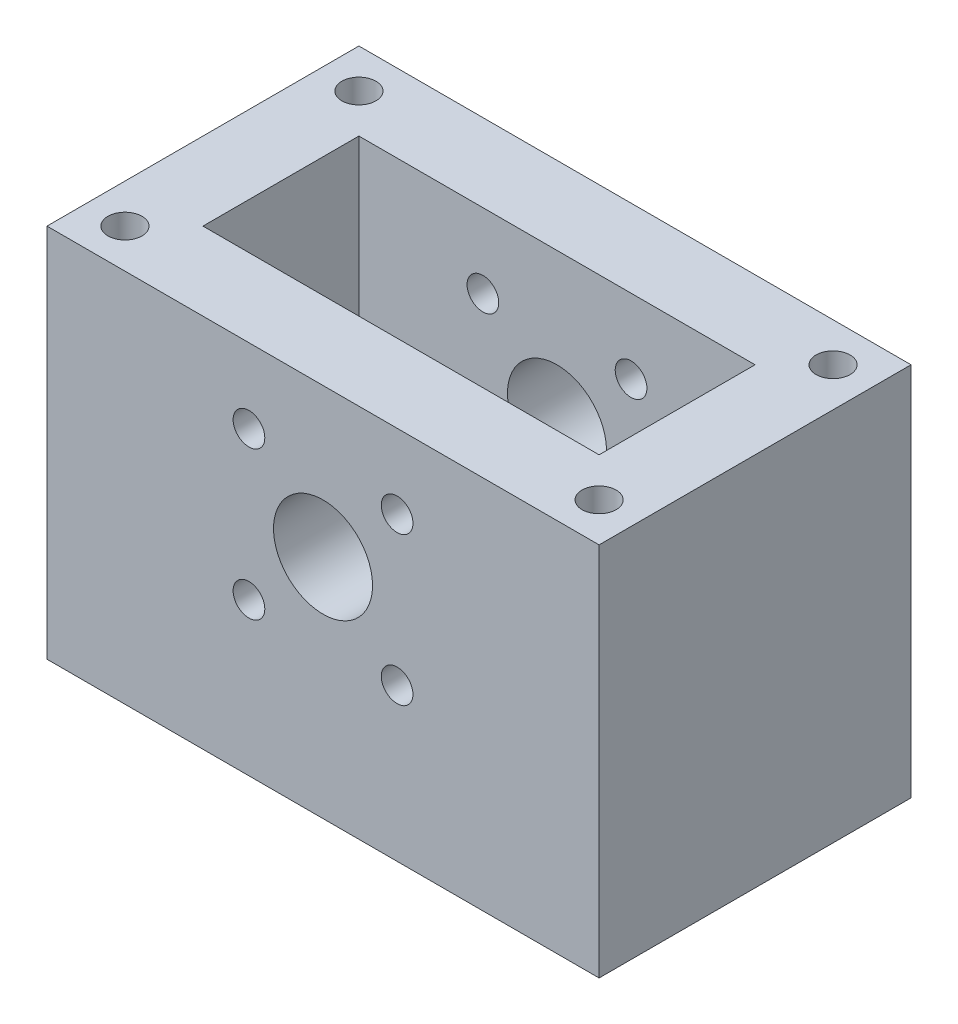
ISO-10303-21;
HEADER;
FILE_DESCRIPTION(('STEP AP214'),'2;1');
FILE_NAME('part.step','',(''),(''),'','','');
FILE_SCHEMA(('AUTOMOTIVE_DESIGN { 1 0 10303 214 1 1 1 1 }'));
ENDSEC;
DATA;
#1=APPLICATION_CONTEXT('core data for automotive mechanical design processes');
#2=APPLICATION_PROTOCOL_DEFINITION('international standard','automotive_design',2000,#1);
#3=PRODUCT_CONTEXT('',#1,'mechanical');
#4=PRODUCT('Part','Part','',(#3));
#5=PRODUCT_RELATED_PRODUCT_CATEGORY('part','',(#4));
#6=PRODUCT_DEFINITION_FORMATION('','',#4);
#7=PRODUCT_DEFINITION_CONTEXT('part definition',#1,'design');
#8=PRODUCT_DEFINITION('design','',#6,#7);
#9=PRODUCT_DEFINITION_SHAPE('','',#8);
#10=(LENGTH_UNIT() NAMED_UNIT(*) SI_UNIT(.MILLI.,.METRE.));
#11=(NAMED_UNIT(*) PLANE_ANGLE_UNIT() SI_UNIT($,.RADIAN.));
#12=(NAMED_UNIT(*) SI_UNIT($,.STERADIAN.) SOLID_ANGLE_UNIT());
#13=UNCERTAINTY_MEASURE_WITH_UNIT(LENGTH_MEASURE(1.E-05),#10,'distance_accuracy_value','');
#14=(GEOMETRIC_REPRESENTATION_CONTEXT(3) GLOBAL_UNCERTAINTY_ASSIGNED_CONTEXT((#13)) GLOBAL_UNIT_ASSIGNED_CONTEXT((#10,
#11,#12)) REPRESENTATION_CONTEXT('',''));
#15=CARTESIAN_POINT('',(0.,0.,0.));
#16=DIRECTION('',(0.,0.,1.));
#17=DIRECTION('',(1.,0.,0.));
#18=AXIS2_PLACEMENT_3D('',#15,#16,#17);
#19=CARTESIAN_POINT('',(25.4,0.,20.));
#20=DIRECTION('',(1.,0.,0.));
#21=DIRECTION('',(0.,1.,0.));
#22=AXIS2_PLACEMENT_3D('',#19,#20,#21);
#23=PLANE('',#22);
#24=DIRECTION('',(0.,1.,0.));
#25=VECTOR('',#24,1.);
#26=CARTESIAN_POINT('',(25.4,0.,15.));
#27=LINE('',#26,#25);
#28=CARTESIAN_POINT('',(25.4,-19.05,15.));
#29=VERTEX_POINT('',#28);
#30=CARTESIAN_POINT('',(25.4,0.,15.));
#31=VERTEX_POINT('',#30);
#32=EDGE_CURVE('E127',#29,#31,#27,.T.);
#33=ORIENTED_EDGE('',*,*,#32,.T.);
#34=DIRECTION('',(0.,0.,-1.));
#35=VECTOR('',#34,1.);
#36=CARTESIAN_POINT('',(25.4,0.,20.));
#37=LINE('',#36,#35);
#38=CARTESIAN_POINT('',(25.4,0.,5.));
#39=VERTEX_POINT('',#38);
#40=EDGE_CURVE('E226',#31,#39,#37,.T.);
#41=ORIENTED_EDGE('',*,*,#40,.T.);
#42=DIRECTION('',(0.,-1.,0.));
#43=VECTOR('',#42,1.);
#44=CARTESIAN_POINT('',(25.4,0.,5.));
#45=LINE('',#44,#43);
#46=CARTESIAN_POINT('',(25.4,-19.05,5.));
#47=VERTEX_POINT('',#46);
#48=EDGE_CURVE('E244',#39,#47,#45,.T.);
#49=ORIENTED_EDGE('',*,*,#48,.T.);
#50=DIRECTION('',(0.,0.,-1.));
#51=VECTOR('',#50,1.);
#52=CARTESIAN_POINT('',(25.4,-19.05,20.));
#53=LINE('',#52,#51);
#54=EDGE_CURVE('E224',#29,#47,#53,.T.);
#55=ORIENTED_EDGE('',*,*,#54,.F.);
#56=EDGE_LOOP('',(#33,#41,#49,#55));
#57=FACE_BOUND('',#56,.T.);
#58=ADVANCED_FACE('F110',(#57),#23,.F.);
#59=CARTESIAN_POINT('',(0.,-19.05,20.));
#60=DIRECTION('',(0.,1.,0.));
#61=DIRECTION('',(0.,0.,1.));
#62=AXIS2_PLACEMENT_3D('',#59,#60,#61);
#63=PLANE('',#62);
#64=DIRECTION('',(0.,0.,-1.));
#65=VECTOR('',#64,1.);
#66=CARTESIAN_POINT('',(0.,-19.05,20.));
#67=LINE('',#66,#65);
#68=CARTESIAN_POINT('',(0.,-19.05,15.));
#69=VERTEX_POINT('',#68);
#70=CARTESIAN_POINT('',(0.,-19.05,5.));
#71=VERTEX_POINT('',#70);
#72=EDGE_CURVE('E222',#69,#71,#67,.T.);
#73=ORIENTED_EDGE('',*,*,#72,.F.);
#74=DIRECTION('',(-1.,0.,0.));
#75=VECTOR('',#74,1.);
#76=CARTESIAN_POINT('',(0.,-19.05,15.));
#77=LINE('',#76,#75);
#78=EDGE_CURVE('E135',#29,#69,#77,.T.);
#79=ORIENTED_EDGE('',*,*,#78,.F.);
#80=ORIENTED_EDGE('',*,*,#54,.T.);
#81=DIRECTION('',(1.,0.,0.));
#82=VECTOR('',#81,1.);
#83=CARTESIAN_POINT('',(0.,-19.05,5.));
#84=LINE('',#83,#82);
#85=EDGE_CURVE('E12',#71,#47,#84,.T.);
#86=ORIENTED_EDGE('',*,*,#85,.F.);
#87=EDGE_LOOP('',(#73,#79,#80,#86));
#88=FACE_BOUND('',#87,.T.);
#89=ADVANCED_FACE('F286',(#88),#63,.T.);
#90=CARTESIAN_POINT('',(0.,0.,20.));
#91=DIRECTION('',(1.,0.,0.));
#92=DIRECTION('',(0.,1.,0.));
#93=AXIS2_PLACEMENT_3D('',#90,#91,#92);
#94=PLANE('',#93);
#95=DIRECTION('',(0.,0.,-1.));
#96=VECTOR('',#95,1.);
#97=CARTESIAN_POINT('',(0.,0.,20.));
#98=LINE('',#97,#96);
#99=CARTESIAN_POINT('',(0.,0.,15.));
#100=VERTEX_POINT('',#99);
#101=CARTESIAN_POINT('',(0.,0.,5.));
#102=VERTEX_POINT('',#101);
#103=EDGE_CURVE('E220',#100,#102,#98,.T.);
#104=ORIENTED_EDGE('',*,*,#103,.F.);
#105=DIRECTION('',(0.,1.,0.));
#106=VECTOR('',#105,1.);
#107=CARTESIAN_POINT('',(0.,0.,15.));
#108=LINE('',#107,#106);
#109=EDGE_CURVE('E351',#69,#100,#108,.T.);
#110=ORIENTED_EDGE('',*,*,#109,.F.);
#111=ORIENTED_EDGE('',*,*,#72,.T.);
#112=DIRECTION('',(0.,-1.,0.));
#113=VECTOR('',#112,1.);
#114=CARTESIAN_POINT('',(0.,0.,5.));
#115=LINE('',#114,#113);
#116=EDGE_CURVE('E119',#102,#71,#115,.T.);
#117=ORIENTED_EDGE('',*,*,#116,.F.);
#118=EDGE_LOOP('',(#104,#110,#111,#117));
#119=FACE_BOUND('',#118,.T.);
#120=ADVANCED_FACE('F291',(#119),#94,.T.);
#121=CARTESIAN_POINT('',(0.,0.,5.));
#122=DIRECTION('',(0.,1.,0.));
#123=DIRECTION('',(0.,0.,1.));
#124=AXIS2_PLACEMENT_3D('',#121,#122,#123);
#125=PLANE('',#124);
#126=CARTESIAN_POINT('',(-2.5,0.,17.5));
#127=DIRECTION('',(0.,1.,0.));
#128=DIRECTION('',(0.,0.,1.));
#129=AXIS2_PLACEMENT_3D('',#126,#127,#128);
#130=CIRCLE('',#129,1.0922);
#131=CARTESIAN_POINT('',(-2.5,0.,18.5922));
#132=VERTEX_POINT('',#131);
#133=EDGE_CURVE('E394',#132,#132,#130,.T.);
#134=ORIENTED_EDGE('',*,*,#133,.F.);
#135=EDGE_LOOP('',(#134));
#136=FACE_BOUND('',#135,.T.);
#137=CARTESIAN_POINT('',(27.9,0.,17.5));
#138=DIRECTION('',(0.,1.,0.));
#139=DIRECTION('',(0.,0.,1.));
#140=AXIS2_PLACEMENT_3D('',#137,#138,#139);
#141=CIRCLE('',#140,1.0922);
#142=CARTESIAN_POINT('',(27.9,0.,18.5922));
#143=VERTEX_POINT('',#142);
#144=EDGE_CURVE('E400',#143,#143,#141,.T.);
#145=ORIENTED_EDGE('',*,*,#144,.F.);
#146=EDGE_LOOP('',(#145));
#147=FACE_BOUND('',#146,.T.);
#148=CARTESIAN_POINT('',(27.9,0.,2.5));
#149=DIRECTION('',(0.,1.,0.));
#150=DIRECTION('',(0.,0.,1.));
#151=AXIS2_PLACEMENT_3D('',#148,#149,#150);
#152=CIRCLE('',#151,1.0922);
#153=CARTESIAN_POINT('',(27.9,0.,3.5922));
#154=VERTEX_POINT('',#153);
#155=EDGE_CURVE('E406',#154,#154,#152,.T.);
#156=ORIENTED_EDGE('',*,*,#155,.F.);
#157=EDGE_LOOP('',(#156));
#158=FACE_BOUND('',#157,.T.);
#159=CARTESIAN_POINT('',(-2.5,0.,2.5));
#160=DIRECTION('',(0.,1.,0.));
#161=DIRECTION('',(0.,0.,1.));
#162=AXIS2_PLACEMENT_3D('',#159,#160,#161);
#163=CIRCLE('',#162,1.0922);
#164=CARTESIAN_POINT('',(-2.5,0.,3.5922));
#165=VERTEX_POINT('',#164);
#166=EDGE_CURVE('E388',#165,#165,#163,.T.);
#167=ORIENTED_EDGE('',*,*,#166,.F.);
#168=EDGE_LOOP('',(#167));
#169=FACE_BOUND('',#168,.T.);
#170=ORIENTED_EDGE('',*,*,#40,.F.);
#171=DIRECTION('',(-1.,0.,0.));
#172=VECTOR('',#171,1.);
#173=CARTESIAN_POINT('',(0.,0.,15.));
#174=LINE('',#173,#172);
#175=EDGE_CURVE('E348',#31,#100,#174,.T.);
#176=ORIENTED_EDGE('',*,*,#175,.T.);
#177=ORIENTED_EDGE('',*,*,#103,.T.);
#178=DIRECTION('',(1.,0.,0.));
#179=VECTOR('',#178,1.);
#180=CARTESIAN_POINT('',(0.,0.,5.));
#181=LINE('',#180,#179);
#182=EDGE_CURVE('E247',#102,#39,#181,.T.);
#183=ORIENTED_EDGE('',*,*,#182,.T.);
#184=EDGE_LOOP('',(#170,#176,#177,#183));
#185=FACE_BOUND('',#184,.T.);
#186=DIRECTION('',(1.,0.,0.));
#187=VECTOR('',#186,1.);
#188=CARTESIAN_POINT('',(0.,0.,0.));
#189=LINE('',#188,#187);
#190=CARTESIAN_POINT('',(-5.00000000000001,0.,0.));
#191=VERTEX_POINT('',#190);
#192=CARTESIAN_POINT('',(30.4,0.,0.));
#193=VERTEX_POINT('',#192);
#194=EDGE_CURVE('E114',#191,#193,#189,.T.);
#195=ORIENTED_EDGE('',*,*,#194,.F.);
#196=DIRECTION('',(0.,0.,-1.));
#197=VECTOR('',#196,1.);
#198=CARTESIAN_POINT('',(-5.00000000000001,0.,20.));
#199=LINE('',#198,#197);
#200=CARTESIAN_POINT('',(-5.00000000000001,0.,20.));
#201=VERTEX_POINT('',#200);
#202=EDGE_CURVE('E217',#201,#191,#199,.T.);
#203=ORIENTED_EDGE('',*,*,#202,.F.);
#204=DIRECTION('',(1.,0.,0.));
#205=VECTOR('',#204,1.);
#206=CARTESIAN_POINT('',(0.,0.,20.));
#207=LINE('',#206,#205);
#208=CARTESIAN_POINT('',(30.4,0.,20.));
#209=VERTEX_POINT('',#208);
#210=EDGE_CURVE('E205',#201,#209,#207,.T.);
#211=ORIENTED_EDGE('',*,*,#210,.T.);
#212=DIRECTION('',(0.,0.,-1.));
#213=VECTOR('',#212,1.);
#214=CARTESIAN_POINT('',(30.4,0.,20.));
#215=LINE('',#214,#213);
#216=EDGE_CURVE('E201',#209,#193,#215,.T.);
#217=ORIENTED_EDGE('',*,*,#216,.T.);
#218=EDGE_LOOP('',(#195,#203,#211,#217));
#219=FACE_BOUND('',#218,.T.);
#220=ADVANCED_FACE('F272',(#136,#147,#158,#169,#185,#219),#125,.T.);
#221=CARTESIAN_POINT('',(7.9502,-4.7752,5.));
#222=DIRECTION('',(0.,0.,-1.));
#223=DIRECTION('',(-1.,0.,0.));
#224=AXIS2_PLACEMENT_3D('',#221,#222,#223);
#225=CYLINDRICAL_SURFACE('',#224,1.016);
#226=CARTESIAN_POINT('',(7.9502,-4.7752,5.));
#227=DIRECTION('',(0.,0.,1.));
#228=DIRECTION('',(1.,0.,0.));
#229=AXIS2_PLACEMENT_3D('',#226,#227,#228);
#230=CIRCLE('',#229,1.016);
#231=CARTESIAN_POINT('',(8.9662,-4.7752,5.));
#232=VERTEX_POINT('',#231);
#233=EDGE_CURVE('E241',#232,#232,#230,.T.);
#234=ORIENTED_EDGE('',*,*,#233,.T.);
#235=EDGE_LOOP('',(#234));
#236=FACE_BOUND('',#235,.T.);
#237=CARTESIAN_POINT('',(7.9502,-4.7752,0.));
#238=DIRECTION('',(0.,0.,1.));
#239=DIRECTION('',(1.,0.,0.));
#240=AXIS2_PLACEMENT_3D('',#237,#238,#239);
#241=CIRCLE('',#240,1.016);
#242=CARTESIAN_POINT('',(8.9662,-4.7752,0.));
#243=VERTEX_POINT('',#242);
#244=EDGE_CURVE('E262',#243,#243,#241,.T.);
#245=ORIENTED_EDGE('',*,*,#244,.F.);
#246=EDGE_LOOP('',(#245));
#247=FACE_BOUND('',#246,.T.);
#248=ADVANCED_FACE('F304',(#236,#247),#225,.F.);
#249=CARTESIAN_POINT('',(17.4498,-4.7752,5.));
#250=DIRECTION('',(0.,0.,-1.));
#251=DIRECTION('',(-1.,0.,0.));
#252=AXIS2_PLACEMENT_3D('',#249,#250,#251);
#253=CYLINDRICAL_SURFACE('',#252,1.016);
#254=CARTESIAN_POINT('',(17.4498,-4.7752,5.));
#255=DIRECTION('',(0.,0.,1.));
#256=DIRECTION('',(1.,0.,0.));
#257=AXIS2_PLACEMENT_3D('',#254,#255,#256);
#258=CIRCLE('',#257,1.016);
#259=CARTESIAN_POINT('',(18.4658,-4.7752,5.));
#260=VERTEX_POINT('',#259);
#261=EDGE_CURVE('E238',#260,#260,#258,.T.);
#262=ORIENTED_EDGE('',*,*,#261,.T.);
#263=EDGE_LOOP('',(#262));
#264=FACE_BOUND('',#263,.T.);
#265=CARTESIAN_POINT('',(17.4498,-4.7752,0.));
#266=DIRECTION('',(0.,0.,1.));
#267=DIRECTION('',(1.,0.,0.));
#268=AXIS2_PLACEMENT_3D('',#265,#266,#267);
#269=CIRCLE('',#268,1.016);
#270=CARTESIAN_POINT('',(18.4658,-4.7752,0.));
#271=VERTEX_POINT('',#270);
#272=EDGE_CURVE('E260',#271,#271,#269,.T.);
#273=ORIENTED_EDGE('',*,*,#272,.F.);
#274=EDGE_LOOP('',(#273));
#275=FACE_BOUND('',#274,.T.);
#276=ADVANCED_FACE('F308',(#264,#275),#253,.F.);
#277=CARTESIAN_POINT('',(7.9502,-14.2748,5.));
#278=DIRECTION('',(0.,0.,-1.));
#279=DIRECTION('',(-1.,0.,0.));
#280=AXIS2_PLACEMENT_3D('',#277,#278,#279);
#281=CYLINDRICAL_SURFACE('',#280,1.016);
#282=CARTESIAN_POINT('',(7.9502,-14.2748,5.));
#283=DIRECTION('',(0.,0.,1.));
#284=DIRECTION('',(1.,0.,0.));
#285=AXIS2_PLACEMENT_3D('',#282,#283,#284);
#286=CIRCLE('',#285,1.016);
#287=CARTESIAN_POINT('',(8.9662,-14.2748,5.));
#288=VERTEX_POINT('',#287);
#289=EDGE_CURVE('E235',#288,#288,#286,.T.);
#290=ORIENTED_EDGE('',*,*,#289,.T.);
#291=EDGE_LOOP('',(#290));
#292=FACE_BOUND('',#291,.T.);
#293=CARTESIAN_POINT('',(7.9502,-14.2748,0.));
#294=DIRECTION('',(0.,0.,1.));
#295=DIRECTION('',(1.,0.,0.));
#296=AXIS2_PLACEMENT_3D('',#293,#294,#295);
#297=CIRCLE('',#296,1.016);
#298=CARTESIAN_POINT('',(8.9662,-14.2748,0.));
#299=VERTEX_POINT('',#298);
#300=EDGE_CURVE('E257',#299,#299,#297,.T.);
#301=ORIENTED_EDGE('',*,*,#300,.F.);
#302=EDGE_LOOP('',(#301));
#303=FACE_BOUND('',#302,.T.);
#304=ADVANCED_FACE('F312',(#292,#303),#281,.F.);
#305=CARTESIAN_POINT('',(17.4498,-14.2748,5.));
#306=DIRECTION('',(0.,0.,-1.));
#307=DIRECTION('',(-1.,0.,0.));
#308=AXIS2_PLACEMENT_3D('',#305,#306,#307);
#309=CYLINDRICAL_SURFACE('',#308,1.016);
#310=CARTESIAN_POINT('',(17.4498,-14.2748,5.));
#311=DIRECTION('',(0.,0.,1.));
#312=DIRECTION('',(1.,0.,0.));
#313=AXIS2_PLACEMENT_3D('',#310,#311,#312);
#314=CIRCLE('',#313,1.016);
#315=CARTESIAN_POINT('',(18.4658,-14.2748,5.));
#316=VERTEX_POINT('',#315);
#317=EDGE_CURVE('E232',#316,#316,#314,.T.);
#318=ORIENTED_EDGE('',*,*,#317,.T.);
#319=EDGE_LOOP('',(#318));
#320=FACE_BOUND('',#319,.T.);
#321=CARTESIAN_POINT('',(17.4498,-14.2748,0.));
#322=DIRECTION('',(0.,0.,1.));
#323=DIRECTION('',(1.,0.,0.));
#324=AXIS2_PLACEMENT_3D('',#321,#322,#323);
#325=CIRCLE('',#324,1.016);
#326=CARTESIAN_POINT('',(18.4658,-14.2748,0.));
#327=VERTEX_POINT('',#326);
#328=EDGE_CURVE('E254',#327,#327,#325,.T.);
#329=ORIENTED_EDGE('',*,*,#328,.F.);
#330=EDGE_LOOP('',(#329));
#331=FACE_BOUND('',#330,.T.);
#332=ADVANCED_FACE('F315',(#320,#331),#309,.F.);
#333=CARTESIAN_POINT('',(12.7,-9.525,5.));
#334=DIRECTION('',(0.,0.,-1.));
#335=DIRECTION('',(-1.,0.,0.));
#336=AXIS2_PLACEMENT_3D('',#333,#334,#335);
#337=CYLINDRICAL_SURFACE('',#336,3.175);
#338=CARTESIAN_POINT('',(12.7,-9.525,5.));
#339=DIRECTION('',(0.,0.,1.));
#340=DIRECTION('',(1.,0.,0.));
#341=AXIS2_PLACEMENT_3D('',#338,#339,#340);
#342=CIRCLE('',#341,3.175);
#343=CARTESIAN_POINT('',(15.875,-9.525,5.));
#344=VERTEX_POINT('',#343);
#345=EDGE_CURVE('E229',#344,#344,#342,.T.);
#346=ORIENTED_EDGE('',*,*,#345,.T.);
#347=EDGE_LOOP('',(#346));
#348=FACE_BOUND('',#347,.T.);
#349=CARTESIAN_POINT('',(12.7,-9.525,0.));
#350=DIRECTION('',(0.,0.,1.));
#351=DIRECTION('',(1.,0.,0.));
#352=AXIS2_PLACEMENT_3D('',#349,#350,#351);
#353=CIRCLE('',#352,3.175);
#354=CARTESIAN_POINT('',(15.875,-9.525,0.));
#355=VERTEX_POINT('',#354);
#356=EDGE_CURVE('E200',#355,#355,#353,.T.);
#357=ORIENTED_EDGE('',*,*,#356,.F.);
#358=EDGE_LOOP('',(#357));
#359=FACE_BOUND('',#358,.T.);
#360=ADVANCED_FACE('F112',(#348,#359),#337,.F.);
#361=CARTESIAN_POINT('',(0.,0.,5.));
#362=DIRECTION('',(0.,0.,1.));
#363=DIRECTION('',(1.,0.,0.));
#364=AXIS2_PLACEMENT_3D('',#361,#362,#363);
#365=PLANE('',#364);
#366=ORIENTED_EDGE('',*,*,#345,.F.);
#367=EDGE_LOOP('',(#366));
#368=FACE_BOUND('',#367,.T.);
#369=ORIENTED_EDGE('',*,*,#317,.F.);
#370=EDGE_LOOP('',(#369));
#371=FACE_BOUND('',#370,.T.);
#372=ORIENTED_EDGE('',*,*,#289,.F.);
#373=EDGE_LOOP('',(#372));
#374=FACE_BOUND('',#373,.T.);
#375=ORIENTED_EDGE('',*,*,#261,.F.);
#376=EDGE_LOOP('',(#375));
#377=FACE_BOUND('',#376,.T.);
#378=ORIENTED_EDGE('',*,*,#233,.F.);
#379=EDGE_LOOP('',(#378));
#380=FACE_BOUND('',#379,.T.);
#381=ORIENTED_EDGE('',*,*,#48,.F.);
#382=ORIENTED_EDGE('',*,*,#182,.F.);
#383=ORIENTED_EDGE('',*,*,#116,.T.);
#384=ORIENTED_EDGE('',*,*,#85,.T.);
#385=EDGE_LOOP('',(#381,#382,#383,#384));
#386=FACE_BOUND('',#385,.T.);
#387=ADVANCED_FACE('F296',(#368,#371,#374,#377,#380,#386),#365,.T.);
#388=CARTESIAN_POINT('',(0.,0.,0.));
#389=DIRECTION('',(0.,0.,1.));
#390=DIRECTION('',(1.,0.,0.));
#391=AXIS2_PLACEMENT_3D('',#388,#389,#390);
#392=PLANE('',#391);
#393=ORIENTED_EDGE('',*,*,#194,.T.);
#394=DIRECTION('',(0.,-1.,0.));
#395=VECTOR('',#394,1.);
#396=CARTESIAN_POINT('',(30.4,0.,0.));
#397=LINE('',#396,#395);
#398=CARTESIAN_POINT('',(30.4,-24.05,0.));
#399=VERTEX_POINT('',#398);
#400=EDGE_CURVE('E213',#193,#399,#397,.T.);
#401=ORIENTED_EDGE('',*,*,#400,.T.);
#402=DIRECTION('',(1.,0.,0.));
#403=VECTOR('',#402,1.);
#404=CARTESIAN_POINT('',(0.,-24.05,0.));
#405=LINE('',#404,#403);
#406=CARTESIAN_POINT('',(-5.,-24.05,0.));
#407=VERTEX_POINT('',#406);
#408=EDGE_CURVE('E196',#407,#399,#405,.T.);
#409=ORIENTED_EDGE('',*,*,#408,.F.);
#410=DIRECTION('',(0.,-1.,0.));
#411=VECTOR('',#410,1.);
#412=CARTESIAN_POINT('',(-5.00000000000001,0.,0.));
#413=LINE('',#412,#411);
#414=EDGE_CURVE('E190',#191,#407,#413,.T.);
#415=ORIENTED_EDGE('',*,*,#414,.F.);
#416=EDGE_LOOP('',(#393,#401,#409,#415));
#417=FACE_BOUND('',#416,.T.);
#418=ORIENTED_EDGE('',*,*,#356,.T.);
#419=EDGE_LOOP('',(#418));
#420=FACE_BOUND('',#419,.T.);
#421=ORIENTED_EDGE('',*,*,#328,.T.);
#422=EDGE_LOOP('',(#421));
#423=FACE_BOUND('',#422,.T.);
#424=ORIENTED_EDGE('',*,*,#300,.T.);
#425=EDGE_LOOP('',(#424));
#426=FACE_BOUND('',#425,.T.);
#427=ORIENTED_EDGE('',*,*,#272,.T.);
#428=EDGE_LOOP('',(#427));
#429=FACE_BOUND('',#428,.T.);
#430=ORIENTED_EDGE('',*,*,#244,.T.);
#431=EDGE_LOOP('',(#430));
#432=FACE_BOUND('',#431,.T.);
#433=ADVANCED_FACE('F268',(#417,#420,#423,#426,#429,#432),#392,.F.);
#434=CARTESIAN_POINT('',(0.,-24.05,20.));
#435=DIRECTION('',(0.,1.,0.));
#436=DIRECTION('',(0.,0.,1.));
#437=AXIS2_PLACEMENT_3D('',#434,#435,#436);
#438=PLANE('',#437);
#439=ORIENTED_EDGE('',*,*,#408,.T.);
#440=DIRECTION('',(0.,0.,-1.));
#441=VECTOR('',#440,1.);
#442=CARTESIAN_POINT('',(30.4,-24.05,20.));
#443=LINE('',#442,#441);
#444=CARTESIAN_POINT('',(30.4,-24.05,20.));
#445=VERTEX_POINT('',#444);
#446=EDGE_CURVE('E193',#445,#399,#443,.T.);
#447=ORIENTED_EDGE('',*,*,#446,.F.);
#448=DIRECTION('',(1.,0.,0.));
#449=VECTOR('',#448,1.);
#450=CARTESIAN_POINT('',(0.,-24.05,20.));
#451=LINE('',#450,#449);
#452=CARTESIAN_POINT('',(-5.,-24.05,20.));
#453=VERTEX_POINT('',#452);
#454=EDGE_CURVE('E178',#453,#445,#451,.T.);
#455=ORIENTED_EDGE('',*,*,#454,.F.);
#456=DIRECTION('',(0.,0.,-1.));
#457=VECTOR('',#456,1.);
#458=CARTESIAN_POINT('',(-5.,-24.05,20.));
#459=LINE('',#458,#457);
#460=EDGE_CURVE('E211',#453,#407,#459,.T.);
#461=ORIENTED_EDGE('',*,*,#460,.T.);
#462=EDGE_LOOP('',(#439,#447,#455,#461));
#463=FACE_BOUND('',#462,.T.);
#464=ADVANCED_FACE('F194',(#463),#438,.F.);
#465=CARTESIAN_POINT('',(30.4,0.,20.));
#466=DIRECTION('',(1.,0.,0.));
#467=DIRECTION('',(0.,1.,0.));
#468=AXIS2_PLACEMENT_3D('',#465,#466,#467);
#469=PLANE('',#468);
#470=ORIENTED_EDGE('',*,*,#400,.F.);
#471=ORIENTED_EDGE('',*,*,#216,.F.);
#472=DIRECTION('',(0.,-1.,0.));
#473=VECTOR('',#472,1.);
#474=CARTESIAN_POINT('',(30.4,0.,20.));
#475=LINE('',#474,#473);
#476=EDGE_CURVE('E183',#209,#445,#475,.T.);
#477=ORIENTED_EDGE('',*,*,#476,.T.);
#478=ORIENTED_EDGE('',*,*,#446,.T.);
#479=EDGE_LOOP('',(#470,#471,#477,#478));
#480=FACE_BOUND('',#479,.T.);
#481=ADVANCED_FACE('F203',(#480),#469,.T.);
#482=CARTESIAN_POINT('',(-5.00000000000001,0.,20.));
#483=DIRECTION('',(1.,0.,0.));
#484=DIRECTION('',(0.,1.,0.));
#485=AXIS2_PLACEMENT_3D('',#482,#483,#484);
#486=PLANE('',#485);
#487=ORIENTED_EDGE('',*,*,#414,.T.);
#488=ORIENTED_EDGE('',*,*,#460,.F.);
#489=DIRECTION('',(0.,-1.,0.));
#490=VECTOR('',#489,1.);
#491=CARTESIAN_POINT('',(-5.00000000000001,0.,20.));
#492=LINE('',#491,#490);
#493=EDGE_CURVE('E186',#201,#453,#492,.T.);
#494=ORIENTED_EDGE('',*,*,#493,.F.);
#495=ORIENTED_EDGE('',*,*,#202,.T.);
#496=EDGE_LOOP('',(#487,#488,#494,#495));
#497=FACE_BOUND('',#496,.T.);
#498=ADVANCED_FACE('F274',(#497),#486,.F.);
#499=CARTESIAN_POINT('',(0.,0.,20.));
#500=DIRECTION('',(0.,0.,1.));
#501=DIRECTION('',(1.,0.,0.));
#502=AXIS2_PLACEMENT_3D('',#499,#500,#501);
#503=PLANE('',#502);
#504=ORIENTED_EDGE('',*,*,#454,.T.);
#505=ORIENTED_EDGE('',*,*,#476,.F.);
#506=ORIENTED_EDGE('',*,*,#210,.F.);
#507=ORIENTED_EDGE('',*,*,#493,.T.);
#508=EDGE_LOOP('',(#504,#505,#506,#507));
#509=FACE_BOUND('',#508,.T.);
#510=CARTESIAN_POINT('',(17.4498,-14.2748,20.));
#511=DIRECTION('',(0.,0.,1.));
#512=DIRECTION('',(1.,0.,0.));
#513=AXIS2_PLACEMENT_3D('',#510,#511,#512);
#514=CIRCLE('',#513,1.016);
#515=CARTESIAN_POINT('',(18.4658,-14.2748,20.));
#516=VERTEX_POINT('',#515);
#517=EDGE_CURVE('E382',#516,#516,#514,.T.);
#518=ORIENTED_EDGE('',*,*,#517,.F.);
#519=EDGE_LOOP('',(#518));
#520=FACE_BOUND('',#519,.T.);
#521=CARTESIAN_POINT('',(7.9502,-14.2748,20.));
#522=DIRECTION('',(0.,0.,1.));
#523=DIRECTION('',(1.,0.,0.));
#524=AXIS2_PLACEMENT_3D('',#521,#522,#523);
#525=CIRCLE('',#524,1.016);
#526=CARTESIAN_POINT('',(8.9662,-14.2748,20.));
#527=VERTEX_POINT('',#526);
#528=EDGE_CURVE('E376',#527,#527,#525,.T.);
#529=ORIENTED_EDGE('',*,*,#528,.F.);
#530=EDGE_LOOP('',(#529));
#531=FACE_BOUND('',#530,.T.);
#532=CARTESIAN_POINT('',(17.4498,-4.7752,20.));
#533=DIRECTION('',(0.,0.,1.));
#534=DIRECTION('',(1.,0.,0.));
#535=AXIS2_PLACEMENT_3D('',#532,#533,#534);
#536=CIRCLE('',#535,1.016);
#537=CARTESIAN_POINT('',(18.4658,-4.7752,20.));
#538=VERTEX_POINT('',#537);
#539=EDGE_CURVE('E370',#538,#538,#536,.T.);
#540=ORIENTED_EDGE('',*,*,#539,.F.);
#541=EDGE_LOOP('',(#540));
#542=FACE_BOUND('',#541,.T.);
#543=CARTESIAN_POINT('',(7.9502,-4.7752,20.));
#544=DIRECTION('',(0.,0.,1.));
#545=DIRECTION('',(1.,0.,0.));
#546=AXIS2_PLACEMENT_3D('',#543,#544,#545);
#547=CIRCLE('',#546,1.016);
#548=CARTESIAN_POINT('',(8.9662,-4.7752,20.));
#549=VERTEX_POINT('',#548);
#550=EDGE_CURVE('E364',#549,#549,#547,.T.);
#551=ORIENTED_EDGE('',*,*,#550,.F.);
#552=EDGE_LOOP('',(#551));
#553=FACE_BOUND('',#552,.T.);
#554=CARTESIAN_POINT('',(12.7,-9.525,20.));
#555=DIRECTION('',(0.,0.,1.));
#556=DIRECTION('',(1.,0.,0.));
#557=AXIS2_PLACEMENT_3D('',#554,#555,#556);
#558=CIRCLE('',#557,3.175);
#559=CARTESIAN_POINT('',(15.875,-9.525,20.));
#560=VERTEX_POINT('',#559);
#561=EDGE_CURVE('E357',#560,#560,#558,.T.);
#562=ORIENTED_EDGE('',*,*,#561,.F.);
#563=EDGE_LOOP('',(#562));
#564=FACE_BOUND('',#563,.T.);
#565=ADVANCED_FACE('F180',(#509,#520,#531,#542,#553,#564),#503,.T.);
#566=CARTESIAN_POINT('',(0.,0.,15.));
#567=DIRECTION('',(0.,0.,1.));
#568=DIRECTION('',(1.,0.,0.));
#569=AXIS2_PLACEMENT_3D('',#566,#567,#568);
#570=PLANE('',#569);
#571=CARTESIAN_POINT('',(17.4498,-14.2748,15.));
#572=DIRECTION('',(0.,0.,1.));
#573=DIRECTION('',(1.,0.,0.));
#574=AXIS2_PLACEMENT_3D('',#571,#572,#573);
#575=CIRCLE('',#574,1.016);
#576=CARTESIAN_POINT('',(18.4658,-14.2748,15.));
#577=VERTEX_POINT('',#576);
#578=EDGE_CURVE('E379',#577,#577,#575,.T.);
#579=ORIENTED_EDGE('',*,*,#578,.T.);
#580=EDGE_LOOP('',(#579));
#581=FACE_BOUND('',#580,.T.);
#582=CARTESIAN_POINT('',(7.9502,-14.2748,15.));
#583=DIRECTION('',(0.,0.,1.));
#584=DIRECTION('',(1.,0.,0.));
#585=AXIS2_PLACEMENT_3D('',#582,#583,#584);
#586=CIRCLE('',#585,1.016);
#587=CARTESIAN_POINT('',(8.9662,-14.2748,15.));
#588=VERTEX_POINT('',#587);
#589=EDGE_CURVE('E373',#588,#588,#586,.T.);
#590=ORIENTED_EDGE('',*,*,#589,.T.);
#591=EDGE_LOOP('',(#590));
#592=FACE_BOUND('',#591,.T.);
#593=CARTESIAN_POINT('',(17.4498,-4.7752,15.));
#594=DIRECTION('',(0.,0.,1.));
#595=DIRECTION('',(1.,0.,0.));
#596=AXIS2_PLACEMENT_3D('',#593,#594,#595);
#597=CIRCLE('',#596,1.016);
#598=CARTESIAN_POINT('',(18.4658,-4.7752,15.));
#599=VERTEX_POINT('',#598);
#600=EDGE_CURVE('E367',#599,#599,#597,.T.);
#601=ORIENTED_EDGE('',*,*,#600,.T.);
#602=EDGE_LOOP('',(#601));
#603=FACE_BOUND('',#602,.T.);
#604=CARTESIAN_POINT('',(7.9502,-4.7752,15.));
#605=DIRECTION('',(0.,0.,1.));
#606=DIRECTION('',(1.,0.,0.));
#607=AXIS2_PLACEMENT_3D('',#604,#605,#606);
#608=CIRCLE('',#607,1.016);
#609=CARTESIAN_POINT('',(8.9662,-4.7752,15.));
#610=VERTEX_POINT('',#609);
#611=EDGE_CURVE('E362',#610,#610,#608,.T.);
#612=ORIENTED_EDGE('',*,*,#611,.T.);
#613=EDGE_LOOP('',(#612));
#614=FACE_BOUND('',#613,.T.);
#615=CARTESIAN_POINT('',(12.7,-9.525,15.));
#616=DIRECTION('',(0.,0.,1.));
#617=DIRECTION('',(1.,0.,0.));
#618=AXIS2_PLACEMENT_3D('',#615,#616,#617);
#619=CIRCLE('',#618,3.175);
#620=CARTESIAN_POINT('',(15.875,-9.525,15.));
#621=VERTEX_POINT('',#620);
#622=EDGE_CURVE('E353',#621,#621,#619,.T.);
#623=ORIENTED_EDGE('',*,*,#622,.T.);
#624=EDGE_LOOP('',(#623));
#625=FACE_BOUND('',#624,.T.);
#626=ORIENTED_EDGE('',*,*,#109,.T.);
#627=ORIENTED_EDGE('',*,*,#175,.F.);
#628=ORIENTED_EDGE('',*,*,#32,.F.);
#629=ORIENTED_EDGE('',*,*,#78,.T.);
#630=EDGE_LOOP('',(#626,#627,#628,#629));
#631=FACE_BOUND('',#630,.T.);
#632=ADVANCED_FACE('F281',(#581,#592,#603,#614,#625,#631),#570,.F.);
#633=CARTESIAN_POINT('',(12.7,-9.525,15.));
#634=DIRECTION('',(0.,0.,1.));
#635=DIRECTION('',(1.,0.,0.));
#636=AXIS2_PLACEMENT_3D('',#633,#634,#635);
#637=CYLINDRICAL_SURFACE('',#636,3.175);
#638=ORIENTED_EDGE('',*,*,#622,.F.);
#639=EDGE_LOOP('',(#638));
#640=FACE_BOUND('',#639,.T.);
#641=ORIENTED_EDGE('',*,*,#561,.T.);
#642=EDGE_LOOP('',(#641));
#643=FACE_BOUND('',#642,.T.);
#644=ADVANCED_FACE('F451',(#640,#643),#637,.F.);
#645=CARTESIAN_POINT('',(7.9502,-4.7752,15.));
#646=DIRECTION('',(0.,0.,1.));
#647=DIRECTION('',(1.,0.,0.));
#648=AXIS2_PLACEMENT_3D('',#645,#646,#647);
#649=CYLINDRICAL_SURFACE('',#648,1.016);
#650=ORIENTED_EDGE('',*,*,#611,.F.);
#651=EDGE_LOOP('',(#650));
#652=FACE_BOUND('',#651,.T.);
#653=ORIENTED_EDGE('',*,*,#550,.T.);
#654=EDGE_LOOP('',(#653));
#655=FACE_BOUND('',#654,.T.);
#656=ADVANCED_FACE('F447',(#652,#655),#649,.F.);
#657=CARTESIAN_POINT('',(17.4498,-4.7752,15.));
#658=DIRECTION('',(0.,0.,1.));
#659=DIRECTION('',(1.,0.,0.));
#660=AXIS2_PLACEMENT_3D('',#657,#658,#659);
#661=CYLINDRICAL_SURFACE('',#660,1.016);
#662=ORIENTED_EDGE('',*,*,#600,.F.);
#663=EDGE_LOOP('',(#662));
#664=FACE_BOUND('',#663,.T.);
#665=ORIENTED_EDGE('',*,*,#539,.T.);
#666=EDGE_LOOP('',(#665));
#667=FACE_BOUND('',#666,.T.);
#668=ADVANCED_FACE('F443',(#664,#667),#661,.F.);
#669=CARTESIAN_POINT('',(7.9502,-14.2748,15.));
#670=DIRECTION('',(0.,0.,1.));
#671=DIRECTION('',(1.,0.,0.));
#672=AXIS2_PLACEMENT_3D('',#669,#670,#671);
#673=CYLINDRICAL_SURFACE('',#672,1.016);
#674=ORIENTED_EDGE('',*,*,#589,.F.);
#675=EDGE_LOOP('',(#674));
#676=FACE_BOUND('',#675,.T.);
#677=ORIENTED_EDGE('',*,*,#528,.T.);
#678=EDGE_LOOP('',(#677));
#679=FACE_BOUND('',#678,.T.);
#680=ADVANCED_FACE('F435',(#676,#679),#673,.F.);
#681=CARTESIAN_POINT('',(17.4498,-14.2748,15.));
#682=DIRECTION('',(0.,0.,1.));
#683=DIRECTION('',(1.,0.,0.));
#684=AXIS2_PLACEMENT_3D('',#681,#682,#683);
#685=CYLINDRICAL_SURFACE('',#684,1.016);
#686=ORIENTED_EDGE('',*,*,#578,.F.);
#687=EDGE_LOOP('',(#686));
#688=FACE_BOUND('',#687,.T.);
#689=ORIENTED_EDGE('',*,*,#517,.T.);
#690=EDGE_LOOP('',(#689));
#691=FACE_BOUND('',#690,.T.);
#692=ADVANCED_FACE('F426',(#688,#691),#685,.F.);
#693=CARTESIAN_POINT('',(-2.5,-10.,2.5));
#694=DIRECTION('',(0.,1.,0.));
#695=DIRECTION('',(0.,0.,1.));
#696=AXIS2_PLACEMENT_3D('',#693,#694,#695);
#697=CYLINDRICAL_SURFACE('',#696,1.0922);
#698=CARTESIAN_POINT('',(-2.5,-10.,2.5));
#699=DIRECTION('',(0.,1.,0.));
#700=DIRECTION('',(0.,0.,1.));
#701=AXIS2_PLACEMENT_3D('',#698,#699,#700);
#702=CIRCLE('',#701,1.0922);
#703=CARTESIAN_POINT('',(-2.5,-10.,3.5922));
#704=VERTEX_POINT('',#703);
#705=EDGE_CURVE('E385',#704,#704,#702,.T.);
#706=ORIENTED_EDGE('',*,*,#705,.F.);
#707=EDGE_LOOP('',(#706));
#708=FACE_BOUND('',#707,.T.);
#709=ORIENTED_EDGE('',*,*,#166,.T.);
#710=EDGE_LOOP('',(#709));
#711=FACE_BOUND('',#710,.T.);
#712=ADVANCED_FACE('F424',(#708,#711),#697,.F.);
#713=CARTESIAN_POINT('',(-2.5,-10.,2.5));
#714=DIRECTION('',(0.,1.,0.));
#715=DIRECTION('',(0.,0.,1.));
#716=AXIS2_PLACEMENT_3D('',#713,#714,#715);
#717=PLANE('',#716);
#718=ORIENTED_EDGE('',*,*,#705,.T.);
#719=EDGE_LOOP('',(#718));
#720=FACE_BOUND('',#719,.T.);
#721=ADVANCED_FACE('F417',(#720),#717,.T.);
#722=CARTESIAN_POINT('',(27.9,-10.,2.5));
#723=DIRECTION('',(0.,1.,0.));
#724=DIRECTION('',(0.,0.,1.));
#725=AXIS2_PLACEMENT_3D('',#722,#723,#724);
#726=CYLINDRICAL_SURFACE('',#725,1.0922);
#727=CARTESIAN_POINT('',(27.9,-10.,2.5));
#728=DIRECTION('',(0.,1.,0.));
#729=DIRECTION('',(0.,0.,1.));
#730=AXIS2_PLACEMENT_3D('',#727,#728,#729);
#731=CIRCLE('',#730,1.0922);
#732=CARTESIAN_POINT('',(27.9,-10.,3.5922));
#733=VERTEX_POINT('',#732);
#734=EDGE_CURVE('E391',#733,#733,#731,.T.);
#735=ORIENTED_EDGE('',*,*,#734,.F.);
#736=EDGE_LOOP('',(#735));
#737=FACE_BOUND('',#736,.T.);
#738=ORIENTED_EDGE('',*,*,#155,.T.);
#739=EDGE_LOOP('',(#738));
#740=FACE_BOUND('',#739,.T.);
#741=ADVANCED_FACE('F414',(#737,#740),#726,.F.);
#742=CARTESIAN_POINT('',(27.9,-10.,2.5));
#743=DIRECTION('',(0.,1.,0.));
#744=DIRECTION('',(0.,0.,1.));
#745=AXIS2_PLACEMENT_3D('',#742,#743,#744);
#746=PLANE('',#745);
#747=ORIENTED_EDGE('',*,*,#734,.T.);
#748=EDGE_LOOP('',(#747));
#749=FACE_BOUND('',#748,.T.);
#750=ADVANCED_FACE('F412',(#749),#746,.T.);
#751=CARTESIAN_POINT('',(27.9,-10.,17.5));
#752=DIRECTION('',(0.,1.,0.));
#753=DIRECTION('',(0.,0.,1.));
#754=AXIS2_PLACEMENT_3D('',#751,#752,#753);
#755=CYLINDRICAL_SURFACE('',#754,1.0922);
#756=CARTESIAN_POINT('',(27.9,-10.,17.5));
#757=DIRECTION('',(0.,1.,0.));
#758=DIRECTION('',(0.,0.,1.));
#759=AXIS2_PLACEMENT_3D('',#756,#757,#758);
#760=CIRCLE('',#759,1.0922);
#761=CARTESIAN_POINT('',(27.9,-10.,18.5922));
#762=VERTEX_POINT('',#761);
#763=EDGE_CURVE('E403',#762,#762,#760,.T.);
#764=ORIENTED_EDGE('',*,*,#763,.F.);
#765=EDGE_LOOP('',(#764));
#766=FACE_BOUND('',#765,.T.);
#767=ORIENTED_EDGE('',*,*,#144,.T.);
#768=EDGE_LOOP('',(#767));
#769=FACE_BOUND('',#768,.T.);
#770=ADVANCED_FACE('F540',(#766,#769),#755,.F.);
#771=CARTESIAN_POINT('',(27.9,-10.,17.5));
#772=DIRECTION('',(0.,1.,0.));
#773=DIRECTION('',(0.,0.,1.));
#774=AXIS2_PLACEMENT_3D('',#771,#772,#773);
#775=PLANE('',#774);
#776=ORIENTED_EDGE('',*,*,#763,.T.);
#777=EDGE_LOOP('',(#776));
#778=FACE_BOUND('',#777,.T.);
#779=ADVANCED_FACE('F549',(#778),#775,.T.);
#780=CARTESIAN_POINT('',(-2.5,-10.,17.5));
#781=DIRECTION('',(0.,1.,0.));
#782=DIRECTION('',(0.,0.,1.));
#783=AXIS2_PLACEMENT_3D('',#780,#781,#782);
#784=CYLINDRICAL_SURFACE('',#783,1.0922);
#785=CARTESIAN_POINT('',(-2.5,-10.,17.5));
#786=DIRECTION('',(0.,1.,0.));
#787=DIRECTION('',(0.,0.,1.));
#788=AXIS2_PLACEMENT_3D('',#785,#786,#787);
#789=CIRCLE('',#788,1.0922);
#790=CARTESIAN_POINT('',(-2.5,-10.,18.5922));
#791=VERTEX_POINT('',#790);
#792=EDGE_CURVE('E397',#791,#791,#789,.T.);
#793=ORIENTED_EDGE('',*,*,#792,.F.);
#794=EDGE_LOOP('',(#793));
#795=FACE_BOUND('',#794,.T.);
#796=ORIENTED_EDGE('',*,*,#133,.T.);
#797=EDGE_LOOP('',(#796));
#798=FACE_BOUND('',#797,.T.);
#799=ADVANCED_FACE('F559',(#795,#798),#784,.F.);
#800=CARTESIAN_POINT('',(-2.5,-10.,17.5));
#801=DIRECTION('',(0.,1.,0.));
#802=DIRECTION('',(0.,0.,1.));
#803=AXIS2_PLACEMENT_3D('',#800,#801,#802);
#804=PLANE('',#803);
#805=ORIENTED_EDGE('',*,*,#792,.T.);
#806=EDGE_LOOP('',(#805));
#807=FACE_BOUND('',#806,.T.);
#808=ADVANCED_FACE('F569',(#807),#804,.T.);
#809=CLOSED_SHELL('',(#58,#89,#120,#220,#248,#276,#304,#332,#360,#387,#433,#464,#481,#498,#565,
#632,#644,#656,#668,#680,#692,#712,#721,#741,#750,#770,#779,#799,#808));
#810=MANIFOLD_SOLID_BREP('B2',#809);
#811=ADVANCED_BREP_SHAPE_REPRESENTATION('',(#18,#810),#14);
#812=SHAPE_DEFINITION_REPRESENTATION(#9,#811);
ENDSEC;
END-ISO-10303-21;
